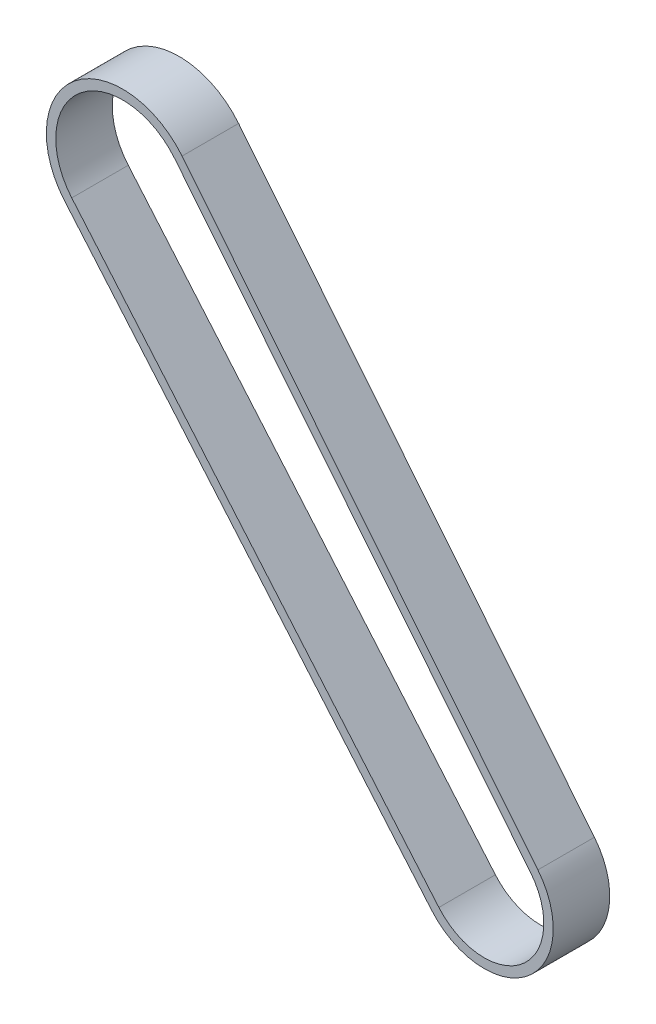
ISO-10303-21;
HEADER;
FILE_DESCRIPTION(('STEP AP214'),'2;1');
FILE_NAME('part.step','',(''),(''),'','','');
FILE_SCHEMA(('AUTOMOTIVE_DESIGN { 1 0 10303 214 1 1 1 1 }'));
ENDSEC;
DATA;
#1=APPLICATION_CONTEXT('core data for automotive mechanical design processes');
#2=APPLICATION_PROTOCOL_DEFINITION('international standard','automotive_design',2000,#1);
#3=PRODUCT_CONTEXT('',#1,'mechanical');
#4=PRODUCT('Part','Part','',(#3));
#5=PRODUCT_RELATED_PRODUCT_CATEGORY('part','',(#4));
#6=PRODUCT_DEFINITION_FORMATION('','',#4);
#7=PRODUCT_DEFINITION_CONTEXT('part definition',#1,'design');
#8=PRODUCT_DEFINITION('design','',#6,#7);
#9=PRODUCT_DEFINITION_SHAPE('','',#8);
#10=(LENGTH_UNIT() NAMED_UNIT(*) SI_UNIT(.MILLI.,.METRE.));
#11=(NAMED_UNIT(*) PLANE_ANGLE_UNIT() SI_UNIT($,.RADIAN.));
#12=(NAMED_UNIT(*) SI_UNIT($,.STERADIAN.) SOLID_ANGLE_UNIT());
#13=UNCERTAINTY_MEASURE_WITH_UNIT(LENGTH_MEASURE(1.E-05),#10,'distance_accuracy_value','');
#14=(GEOMETRIC_REPRESENTATION_CONTEXT(3) GLOBAL_UNCERTAINTY_ASSIGNED_CONTEXT((#13)) GLOBAL_UNIT_ASSIGNED_CONTEXT((#10,
#11,#12)) REPRESENTATION_CONTEXT('',''));
#15=CARTESIAN_POINT('',(0.,0.,0.));
#16=DIRECTION('',(0.,0.,1.));
#17=DIRECTION('',(1.,0.,0.));
#18=AXIS2_PLACEMENT_3D('',#15,#16,#17);
#19=CARTESIAN_POINT('',(8.13671235423696E-07,1.59069146743462E-08,6.));
#20=DIRECTION('',(0.,0.,-1.));
#21=DIRECTION('',(-1.,0.,0.));
#22=AXIS2_PLACEMENT_3D('',#19,#20,#21);
#23=PLANE('',#22);
#24=CARTESIAN_POINT('',(8.13671235423696E-07,1.59069146743462E-08,6.));
#25=DIRECTION('',(0.,0.,-1.));
#26=DIRECTION('',(-1.,0.,0.));
#27=AXIS2_PLACEMENT_3D('',#24,#25,#26);
#28=CIRCLE('',#27,8.10403365400965);
#29=CARTESIAN_POINT('',(6.30291518480261,5.09397998205388,6.));
#30=VERTEX_POINT('',#29);
#31=CARTESIAN_POINT('',(-6.16872596452669,-5.25567990216885,6.));
#32=VERTEX_POINT('',#31);
#33=EDGE_CURVE('E161',#30,#32,#28,.F.);
#34=ORIENTED_EDGE('',*,*,#33,.T.);
#35=DIRECTION('',(0.648526418134432,-0.761192147214962,0.));
#36=VECTOR('',#35,1.);
#37=CARTESIAN_POINT('',(-6.16872596452669,-5.25567990216885,6.));
#38=LINE('',#37,#36);
#39=CARTESIAN_POINT('',(32.7983310510716,-50.9923175640176,6.));
#40=VERTEX_POINT('',#39);
#41=EDGE_CURVE('E164',#32,#40,#38,.T.);
#42=ORIENTED_EDGE('',*,*,#41,.T.);
#43=CARTESIAN_POINT('',(38.3740635294212,-46.2418615511829,6.));
#44=DIRECTION('',(0.,0.,-1.));
#45=DIRECTION('',(-1.,0.,0.));
#46=AXIS2_PLACEMENT_3D('',#43,#44,#45);
#47=CIRCLE('',#46,7.325);
#48=CARTESIAN_POINT('',(44.0710842649773,-41.6375614155875,6.));
#49=VERTEX_POINT('',#48);
#50=EDGE_CURVE('E167',#40,#49,#47,.F.);
#51=ORIENTED_EDGE('',*,*,#50,.T.);
#52=DIRECTION('',(-0.628573397350911,0.777750271065677,0.));
#53=VECTOR('',#52,1.);
#54=CARTESIAN_POINT('',(6.30291518480261,5.09397998205388,6.));
#55=LINE('',#54,#53);
#56=EDGE_CURVE('E169',#49,#30,#55,.T.);
#57=ORIENTED_EDGE('',*,*,#56,.T.);
#58=EDGE_LOOP('',(#34,#42,#51,#57));
#59=FACE_BOUND('',#58,.T.);
#60=CARTESIAN_POINT('',(8.13671235423696E-07,1.59069146743462E-08,6.));
#61=DIRECTION('',(0.,0.,1.));
#62=DIRECTION('',(-1.,0.,0.));
#63=AXIS2_PLACEMENT_3D('',#60,#61,#62);
#64=CIRCLE('',#63,7.10403365400966);
#65=CARTESIAN_POINT('',(5.52516491373694,4.46540658470297,6.));
#66=VERTEX_POINT('',#65);
#67=CARTESIAN_POINT('',(-5.40753381731173,-4.60715348403443,6.));
#68=VERTEX_POINT('',#67);
#69=EDGE_CURVE('E125',#66,#68,#64,.T.);
#70=ORIENTED_EDGE('',*,*,#69,.F.);
#71=DIRECTION('',(-0.628573397350911,0.777750271065677,0.));
#72=VECTOR('',#71,1.);
#73=CARTESIAN_POINT('',(5.52516491373694,4.46540658470297,6.));
#74=LINE('',#73,#72);
#75=CARTESIAN_POINT('',(43.2933339939116,-42.2661348129384,6.));
#76=VERTEX_POINT('',#75);
#77=EDGE_CURVE('E147',#76,#66,#74,.T.);
#78=ORIENTED_EDGE('',*,*,#77,.F.);
#79=CARTESIAN_POINT('',(38.3740635294212,-46.2418615511829,6.));
#80=DIRECTION('',(0.,0.,1.));
#81=DIRECTION('',(-1.,0.,0.));
#82=AXIS2_PLACEMENT_3D('',#79,#80,#81);
#83=CIRCLE('',#82,6.325);
#84=CARTESIAN_POINT('',(33.5595231982866,-50.3437911458832,6.));
#85=VERTEX_POINT('',#84);
#86=EDGE_CURVE('E145',#85,#76,#83,.T.);
#87=ORIENTED_EDGE('',*,*,#86,.F.);
#88=DIRECTION('',(0.648526418134432,-0.761192147214962,0.));
#89=VECTOR('',#88,1.);
#90=CARTESIAN_POINT('',(33.5595231982866,-50.3437911458832,6.));
#91=LINE('',#90,#89);
#92=EDGE_CURVE('E133',#68,#85,#91,.T.);
#93=ORIENTED_EDGE('',*,*,#92,.F.);
#94=EDGE_LOOP('',(#70,#78,#87,#93));
#95=FACE_BOUND('',#94,.T.);
#96=ADVANCED_FACE('F60',(#59,#95),#23,.F.);
#97=CARTESIAN_POINT('',(8.13671235423696E-07,1.59069146743462E-08,0.));
#98=DIRECTION('',(0.,0.,-1.));
#99=DIRECTION('',(-1.,0.,0.));
#100=AXIS2_PLACEMENT_3D('',#97,#98,#99);
#101=PLANE('',#100);
#102=CARTESIAN_POINT('',(8.13671235423696E-07,1.59069146743462E-08,0.));
#103=DIRECTION('',(0.,0.,-1.));
#104=DIRECTION('',(-1.,0.,0.));
#105=AXIS2_PLACEMENT_3D('',#102,#103,#104);
#106=CIRCLE('',#105,8.10403365400965);
#107=CARTESIAN_POINT('',(6.30291518480261,5.09397998205388,0.));
#108=VERTEX_POINT('',#107);
#109=CARTESIAN_POINT('',(-6.16872596452669,-5.25567990216885,0.));
#110=VERTEX_POINT('',#109);
#111=EDGE_CURVE('E141',#108,#110,#106,.F.);
#112=ORIENTED_EDGE('',*,*,#111,.F.);
#113=DIRECTION('',(-0.628573397350911,0.777750271065677,0.));
#114=VECTOR('',#113,1.);
#115=CARTESIAN_POINT('',(6.30291518480261,5.09397998205388,0.));
#116=LINE('',#115,#114);
#117=CARTESIAN_POINT('',(44.0710842649773,-41.6375614155875,0.));
#118=VERTEX_POINT('',#117);
#119=EDGE_CURVE('E165',#118,#108,#116,.T.);
#120=ORIENTED_EDGE('',*,*,#119,.F.);
#121=CARTESIAN_POINT('',(38.3740635294212,-46.2418615511829,0.));
#122=DIRECTION('',(0.,0.,-1.));
#123=DIRECTION('',(-1.,0.,0.));
#124=AXIS2_PLACEMENT_3D('',#121,#122,#123);
#125=CIRCLE('',#124,7.325);
#126=CARTESIAN_POINT('',(32.7983310510716,-50.9923175640176,0.));
#127=VERTEX_POINT('',#126);
#128=EDGE_CURVE('E176',#127,#118,#125,.F.);
#129=ORIENTED_EDGE('',*,*,#128,.F.);
#130=DIRECTION('',(0.648526418134432,-0.761192147214962,0.));
#131=VECTOR('',#130,1.);
#132=CARTESIAN_POINT('',(-6.16872596452669,-5.25567990216885,0.));
#133=LINE('',#132,#131);
#134=EDGE_CURVE('E174',#110,#127,#133,.T.);
#135=ORIENTED_EDGE('',*,*,#134,.F.);
#136=EDGE_LOOP('',(#112,#120,#129,#135));
#137=FACE_BOUND('',#136,.T.);
#138=DIRECTION('',(-0.628573397350911,0.777750271065677,0.));
#139=VECTOR('',#138,1.);
#140=CARTESIAN_POINT('',(5.52516491373694,4.46540658470297,0.));
#141=LINE('',#140,#139);
#142=CARTESIAN_POINT('',(43.2933339939116,-42.2661348129384,0.));
#143=VERTEX_POINT('',#142);
#144=CARTESIAN_POINT('',(5.52516491373693,4.46540658470297,0.));
#145=VERTEX_POINT('',#144);
#146=EDGE_CURVE('E134',#143,#145,#141,.T.);
#147=ORIENTED_EDGE('',*,*,#146,.T.);
#148=CARTESIAN_POINT('',(8.13671235423696E-07,1.59069146743462E-08,0.));
#149=DIRECTION('',(0.,0.,1.));
#150=DIRECTION('',(-1.,0.,0.));
#151=AXIS2_PLACEMENT_3D('',#148,#149,#150);
#152=CIRCLE('',#151,7.10403365400966);
#153=CARTESIAN_POINT('',(-5.40753381731173,-4.60715348403443,0.));
#154=VERTEX_POINT('',#153);
#155=EDGE_CURVE('E83',#145,#154,#152,.T.);
#156=ORIENTED_EDGE('',*,*,#155,.T.);
#157=DIRECTION('',(0.648526418134432,-0.761192147214962,0.));
#158=VECTOR('',#157,1.);
#159=CARTESIAN_POINT('',(33.5595231982866,-50.3437911458832,0.));
#160=LINE('',#159,#158);
#161=CARTESIAN_POINT('',(33.5595231982866,-50.3437911458832,0.));
#162=VERTEX_POINT('',#161);
#163=EDGE_CURVE('E140',#154,#162,#160,.T.);
#164=ORIENTED_EDGE('',*,*,#163,.T.);
#165=CARTESIAN_POINT('',(38.3740635294212,-46.2418615511829,0.));
#166=DIRECTION('',(0.,0.,1.));
#167=DIRECTION('',(-1.,0.,0.));
#168=AXIS2_PLACEMENT_3D('',#165,#166,#167);
#169=CIRCLE('',#168,6.325);
#170=EDGE_CURVE('E153',#162,#143,#169,.T.);
#171=ORIENTED_EDGE('',*,*,#170,.T.);
#172=EDGE_LOOP('',(#147,#156,#164,#171));
#173=FACE_BOUND('',#172,.T.);
#174=ADVANCED_FACE('F194',(#137,#173),#101,.T.);
#175=CARTESIAN_POINT('',(8.13671235423696E-07,1.59069146743462E-08,6.));
#176=DIRECTION('',(0.,0.,-1.));
#177=DIRECTION('',(-1.,0.,0.));
#178=AXIS2_PLACEMENT_3D('',#175,#176,#177);
#179=CYLINDRICAL_SURFACE('',#178,8.10403365400965);
#180=ORIENTED_EDGE('',*,*,#111,.T.);
#181=DIRECTION('',(0.,0.,-1.));
#182=VECTOR('',#181,1.);
#183=CARTESIAN_POINT('',(-6.16872596452669,-5.25567990216885,6.));
#184=LINE('',#183,#182);
#185=EDGE_CURVE('E12',#32,#110,#184,.T.);
#186=ORIENTED_EDGE('',*,*,#185,.F.);
#187=ORIENTED_EDGE('',*,*,#33,.F.);
#188=DIRECTION('',(0.,0.,-1.));
#189=VECTOR('',#188,1.);
#190=CARTESIAN_POINT('',(6.30291518480261,5.09397998205388,6.));
#191=LINE('',#190,#189);
#192=EDGE_CURVE('E171',#30,#108,#191,.T.);
#193=ORIENTED_EDGE('',*,*,#192,.T.);
#194=EDGE_LOOP('',(#180,#186,#187,#193));
#195=FACE_BOUND('',#194,.T.);
#196=ADVANCED_FACE('F62',(#195),#179,.T.);
#197=CARTESIAN_POINT('',(-6.16872596452669,-5.25567990216885,6.));
#198=DIRECTION('',(0.761192147214962,0.648526418134431,0.));
#199=DIRECTION('',(-0.648526418134432,0.761192147214962,0.));
#200=AXIS2_PLACEMENT_3D('',#197,#198,#199);
#201=PLANE('',#200);
#202=ORIENTED_EDGE('',*,*,#134,.T.);
#203=DIRECTION('',(0.,0.,-1.));
#204=VECTOR('',#203,1.);
#205=CARTESIAN_POINT('',(32.7983310510716,-50.9923175640176,6.));
#206=LINE('',#205,#204);
#207=EDGE_CURVE('E68',#40,#127,#206,.T.);
#208=ORIENTED_EDGE('',*,*,#207,.F.);
#209=ORIENTED_EDGE('',*,*,#41,.F.);
#210=ORIENTED_EDGE('',*,*,#185,.T.);
#211=EDGE_LOOP('',(#202,#208,#209,#210));
#212=FACE_BOUND('',#211,.T.);
#213=ADVANCED_FACE('F204',(#212),#201,.F.);
#214=CARTESIAN_POINT('',(38.3740635294212,-46.2418615511829,6.));
#215=DIRECTION('',(0.,0.,-1.));
#216=DIRECTION('',(-1.,0.,0.));
#217=AXIS2_PLACEMENT_3D('',#214,#215,#216);
#218=CYLINDRICAL_SURFACE('',#217,7.325);
#219=ORIENTED_EDGE('',*,*,#128,.T.);
#220=DIRECTION('',(0.,0.,-1.));
#221=VECTOR('',#220,1.);
#222=CARTESIAN_POINT('',(44.0710842649773,-41.6375614155875,6.));
#223=LINE('',#222,#221);
#224=EDGE_CURVE('E181',#49,#118,#223,.T.);
#225=ORIENTED_EDGE('',*,*,#224,.F.);
#226=ORIENTED_EDGE('',*,*,#50,.F.);
#227=ORIENTED_EDGE('',*,*,#207,.T.);
#228=EDGE_LOOP('',(#219,#225,#226,#227));
#229=FACE_BOUND('',#228,.T.);
#230=ADVANCED_FACE('F188',(#229),#218,.T.);
#231=CARTESIAN_POINT('',(6.30291518480261,5.09397998205388,6.));
#232=DIRECTION('',(-0.777750271065677,-0.628573397350911,0.));
#233=DIRECTION('',(0.628573397350911,-0.777750271065677,0.));
#234=AXIS2_PLACEMENT_3D('',#231,#232,#233);
#235=PLANE('',#234);
#236=ORIENTED_EDGE('',*,*,#119,.T.);
#237=ORIENTED_EDGE('',*,*,#192,.F.);
#238=ORIENTED_EDGE('',*,*,#56,.F.);
#239=ORIENTED_EDGE('',*,*,#224,.T.);
#240=EDGE_LOOP('',(#236,#237,#238,#239));
#241=FACE_BOUND('',#240,.T.);
#242=ADVANCED_FACE('F198',(#241),#235,.F.);
#243=CARTESIAN_POINT('',(8.13671235423696E-07,1.59069146743462E-08,6.));
#244=DIRECTION('',(0.,0.,-1.));
#245=DIRECTION('',(-1.,0.,0.));
#246=AXIS2_PLACEMENT_3D('',#243,#244,#245);
#247=CYLINDRICAL_SURFACE('',#246,7.10403365400966);
#248=ORIENTED_EDGE('',*,*,#155,.F.);
#249=DIRECTION('',(0.,0.,-1.));
#250=VECTOR('',#249,1.);
#251=CARTESIAN_POINT('',(5.52516491373694,4.46540658470297,6.));
#252=LINE('',#251,#250);
#253=EDGE_CURVE('E129',#66,#145,#252,.T.);
#254=ORIENTED_EDGE('',*,*,#253,.F.);
#255=ORIENTED_EDGE('',*,*,#69,.T.);
#256=DIRECTION('',(0.,0.,-1.));
#257=VECTOR('',#256,1.);
#258=CARTESIAN_POINT('',(-5.40753381731173,-4.60715348403443,6.));
#259=LINE('',#258,#257);
#260=EDGE_CURVE('E128',#68,#154,#259,.T.);
#261=ORIENTED_EDGE('',*,*,#260,.T.);
#262=EDGE_LOOP('',(#248,#254,#255,#261));
#263=FACE_BOUND('',#262,.T.);
#264=ADVANCED_FACE('F127',(#263),#247,.F.);
#265=CARTESIAN_POINT('',(33.5595231982866,-50.3437911458832,6.));
#266=DIRECTION('',(0.761192147214962,0.648526418134431,0.));
#267=DIRECTION('',(-0.648526418134432,0.761192147214962,0.));
#268=AXIS2_PLACEMENT_3D('',#265,#266,#267);
#269=PLANE('',#268);
#270=ORIENTED_EDGE('',*,*,#163,.F.);
#271=ORIENTED_EDGE('',*,*,#260,.F.);
#272=ORIENTED_EDGE('',*,*,#92,.T.);
#273=DIRECTION('',(0.,0.,-1.));
#274=VECTOR('',#273,1.);
#275=CARTESIAN_POINT('',(33.5595231982866,-50.3437911458832,6.));
#276=LINE('',#275,#274);
#277=EDGE_CURVE('E142',#85,#162,#276,.T.);
#278=ORIENTED_EDGE('',*,*,#277,.T.);
#279=EDGE_LOOP('',(#270,#271,#272,#278));
#280=FACE_BOUND('',#279,.T.);
#281=ADVANCED_FACE('F137',(#280),#269,.T.);
#282=CARTESIAN_POINT('',(38.3740635294212,-46.2418615511829,6.));
#283=DIRECTION('',(0.,0.,-1.));
#284=DIRECTION('',(-1.,0.,0.));
#285=AXIS2_PLACEMENT_3D('',#282,#283,#284);
#286=CYLINDRICAL_SURFACE('',#285,6.325);
#287=ORIENTED_EDGE('',*,*,#170,.F.);
#288=ORIENTED_EDGE('',*,*,#277,.F.);
#289=ORIENTED_EDGE('',*,*,#86,.T.);
#290=DIRECTION('',(0.,0.,-1.));
#291=VECTOR('',#290,1.);
#292=CARTESIAN_POINT('',(43.2933339939116,-42.2661348129384,6.));
#293=LINE('',#292,#291);
#294=EDGE_CURVE('E75',#76,#143,#293,.T.);
#295=ORIENTED_EDGE('',*,*,#294,.T.);
#296=EDGE_LOOP('',(#287,#288,#289,#295));
#297=FACE_BOUND('',#296,.T.);
#298=ADVANCED_FACE('F227',(#297),#286,.F.);
#299=CARTESIAN_POINT('',(5.52516491373694,4.46540658470297,6.));
#300=DIRECTION('',(-0.777750271065677,-0.628573397350911,0.));
#301=DIRECTION('',(0.628573397350911,-0.777750271065677,0.));
#302=AXIS2_PLACEMENT_3D('',#299,#300,#301);
#303=PLANE('',#302);
#304=ORIENTED_EDGE('',*,*,#146,.F.);
#305=ORIENTED_EDGE('',*,*,#294,.F.);
#306=ORIENTED_EDGE('',*,*,#77,.T.);
#307=ORIENTED_EDGE('',*,*,#253,.T.);
#308=EDGE_LOOP('',(#304,#305,#306,#307));
#309=FACE_BOUND('',#308,.T.);
#310=ADVANCED_FACE('F231',(#309),#303,.T.);
#311=CLOSED_SHELL('',(#96,#174,#196,#213,#230,#242,#264,#281,#298,#310));
#312=MANIFOLD_SOLID_BREP('B2',#311);
#313=ADVANCED_BREP_SHAPE_REPRESENTATION('',(#18,#312),#14);
#314=SHAPE_DEFINITION_REPRESENTATION(#9,#313);
ENDSEC;
END-ISO-10303-21;
